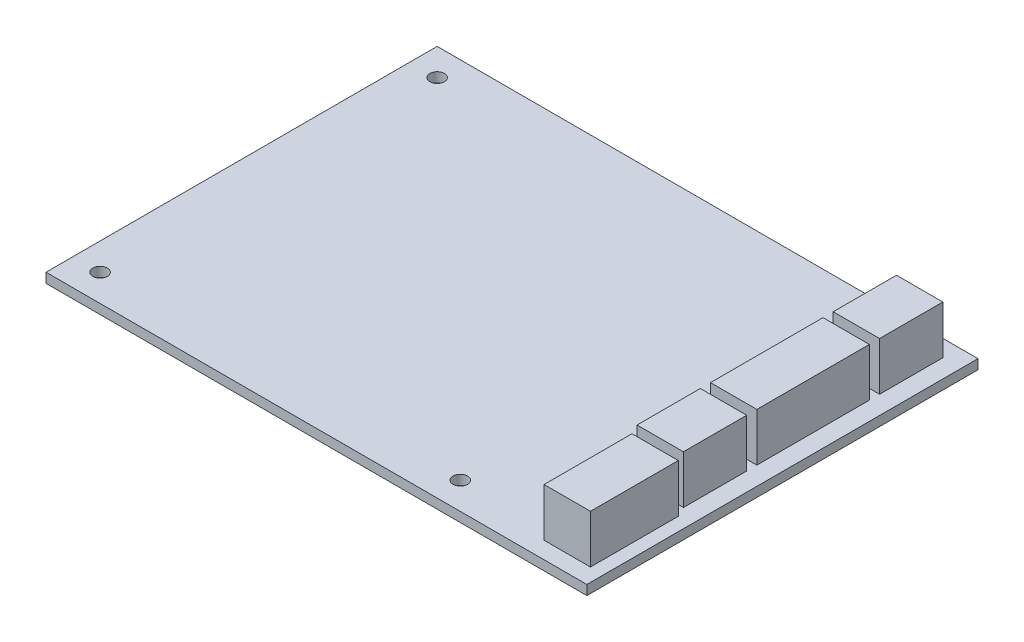
ISO-10303-21;
HEADER;
FILE_DESCRIPTION(('STEP AP214'),'2;1');
FILE_NAME('part.step','',(''),(''),'','','');
FILE_SCHEMA(('AUTOMOTIVE_DESIGN { 1 0 10303 214 1 1 1 1 }'));
ENDSEC;
DATA;
#1=APPLICATION_CONTEXT('core data for automotive mechanical design processes');
#2=APPLICATION_PROTOCOL_DEFINITION('international standard','automotive_design',2000,#1);
#3=PRODUCT_CONTEXT('',#1,'mechanical');
#4=PRODUCT('Part','Part','',(#3));
#5=PRODUCT_RELATED_PRODUCT_CATEGORY('part','',(#4));
#6=PRODUCT_DEFINITION_FORMATION('','',#4);
#7=PRODUCT_DEFINITION_CONTEXT('part definition',#1,'design');
#8=PRODUCT_DEFINITION('design','',#6,#7);
#9=PRODUCT_DEFINITION_SHAPE('','',#8);
#10=(LENGTH_UNIT() NAMED_UNIT(*) SI_UNIT(.MILLI.,.METRE.));
#11=(NAMED_UNIT(*) PLANE_ANGLE_UNIT() SI_UNIT($,.RADIAN.));
#12=(NAMED_UNIT(*) SI_UNIT($,.STERADIAN.) SOLID_ANGLE_UNIT());
#13=UNCERTAINTY_MEASURE_WITH_UNIT(LENGTH_MEASURE(1.E-05),#10,'distance_accuracy_value','');
#14=(GEOMETRIC_REPRESENTATION_CONTEXT(3) GLOBAL_UNCERTAINTY_ASSIGNED_CONTEXT((#13)) GLOBAL_UNIT_ASSIGNED_CONTEXT((#10,
#11,#12)) REPRESENTATION_CONTEXT('',''));
#15=CARTESIAN_POINT('',(0.,0.,0.));
#16=DIRECTION('',(0.,0.,1.));
#17=DIRECTION('',(1.,0.,0.));
#18=AXIS2_PLACEMENT_3D('',#15,#16,#17);
#19=CARTESIAN_POINT('',(56.,2.,40.5));
#20=DIRECTION('',(-1.,0.,0.));
#21=DIRECTION('',(0.,0.,1.));
#22=AXIS2_PLACEMENT_3D('',#19,#20,#21);
#23=PLANE('',#22);
#24=DIRECTION('',(0.,0.,-1.));
#25=VECTOR('',#24,1.);
#26=CARTESIAN_POINT('',(56.,0.,40.5));
#27=LINE('',#26,#25);
#28=CARTESIAN_POINT('',(56.,0.,40.5));
#29=VERTEX_POINT('',#28);
#30=CARTESIAN_POINT('',(56.,0.,-40.5));
#31=VERTEX_POINT('',#30);
#32=EDGE_CURVE('E394',#29,#31,#27,.T.);
#33=ORIENTED_EDGE('',*,*,#32,.T.);
#34=DIRECTION('',(0.,-1.,0.));
#35=VECTOR('',#34,1.);
#36=CARTESIAN_POINT('',(56.,2.,-40.5));
#37=LINE('',#36,#35);
#38=CARTESIAN_POINT('',(56.,2.,-40.5));
#39=VERTEX_POINT('',#38);
#40=EDGE_CURVE('E11',#39,#31,#37,.T.);
#41=ORIENTED_EDGE('',*,*,#40,.F.);
#42=DIRECTION('',(0.,0.,-1.));
#43=VECTOR('',#42,1.);
#44=CARTESIAN_POINT('',(56.,2.,40.5));
#45=LINE('',#44,#43);
#46=CARTESIAN_POINT('',(56.,2.,40.5));
#47=VERTEX_POINT('',#46);
#48=EDGE_CURVE('E379',#47,#39,#45,.T.);
#49=ORIENTED_EDGE('',*,*,#48,.F.);
#50=DIRECTION('',(0.,-1.,0.));
#51=VECTOR('',#50,1.);
#52=CARTESIAN_POINT('',(56.,2.,40.5));
#53=LINE('',#52,#51);
#54=EDGE_CURVE('E393',#47,#29,#53,.T.);
#55=ORIENTED_EDGE('',*,*,#54,.T.);
#56=EDGE_LOOP('',(#33,#41,#49,#55));
#57=FACE_BOUND('',#56,.T.);
#58=ADVANCED_FACE('F39',(#57),#23,.F.);
#59=CARTESIAN_POINT('',(-56.,2.,-40.5));
#60=DIRECTION('',(0.,0.,1.));
#61=DIRECTION('',(1.,0.,0.));
#62=AXIS2_PLACEMENT_3D('',#59,#60,#61);
#63=PLANE('',#62);
#64=DIRECTION('',(-1.,0.,0.));
#65=VECTOR('',#64,1.);
#66=CARTESIAN_POINT('',(-56.,0.,-40.5));
#67=LINE('',#66,#65);
#68=CARTESIAN_POINT('',(-56.,0.,-40.5));
#69=VERTEX_POINT('',#68);
#70=EDGE_CURVE('E398',#31,#69,#67,.T.);
#71=ORIENTED_EDGE('',*,*,#70,.T.);
#72=DIRECTION('',(0.,-1.,0.));
#73=VECTOR('',#72,1.);
#74=CARTESIAN_POINT('',(-56.,2.,-40.5));
#75=LINE('',#74,#73);
#76=CARTESIAN_POINT('',(-56.,2.,-40.5));
#77=VERTEX_POINT('',#76);
#78=EDGE_CURVE('E48',#77,#69,#75,.T.);
#79=ORIENTED_EDGE('',*,*,#78,.F.);
#80=DIRECTION('',(-1.,0.,0.));
#81=VECTOR('',#80,1.);
#82=CARTESIAN_POINT('',(-56.,2.,-40.5));
#83=LINE('',#82,#81);
#84=EDGE_CURVE('E383',#39,#77,#83,.T.);
#85=ORIENTED_EDGE('',*,*,#84,.F.);
#86=ORIENTED_EDGE('',*,*,#40,.T.);
#87=EDGE_LOOP('',(#71,#79,#85,#86));
#88=FACE_BOUND('',#87,.T.);
#89=ADVANCED_FACE('F461',(#88),#63,.F.);
#90=CARTESIAN_POINT('',(-56.,2.,40.5));
#91=DIRECTION('',(1.,0.,0.));
#92=DIRECTION('',(0.,0.,-1.));
#93=AXIS2_PLACEMENT_3D('',#90,#91,#92);
#94=PLANE('',#93);
#95=DIRECTION('',(0.,0.,1.));
#96=VECTOR('',#95,1.);
#97=CARTESIAN_POINT('',(-56.,0.,40.5));
#98=LINE('',#97,#96);
#99=CARTESIAN_POINT('',(-56.,0.,40.5));
#100=VERTEX_POINT('',#99);
#101=EDGE_CURVE('E401',#69,#100,#98,.T.);
#102=ORIENTED_EDGE('',*,*,#101,.T.);
#103=DIRECTION('',(0.,-1.,0.));
#104=VECTOR('',#103,1.);
#105=CARTESIAN_POINT('',(-56.,2.,40.5));
#106=LINE('',#105,#104);
#107=CARTESIAN_POINT('',(-56.,2.,40.5));
#108=VERTEX_POINT('',#107);
#109=EDGE_CURVE('E409',#108,#100,#106,.T.);
#110=ORIENTED_EDGE('',*,*,#109,.F.);
#111=DIRECTION('',(0.,0.,1.));
#112=VECTOR('',#111,1.);
#113=CARTESIAN_POINT('',(-56.,2.,40.5));
#114=LINE('',#113,#112);
#115=EDGE_CURVE('E387',#77,#108,#114,.T.);
#116=ORIENTED_EDGE('',*,*,#115,.F.);
#117=ORIENTED_EDGE('',*,*,#78,.T.);
#118=EDGE_LOOP('',(#102,#110,#116,#117));
#119=FACE_BOUND('',#118,.T.);
#120=ADVANCED_FACE('F458',(#119),#94,.F.);
#121=CARTESIAN_POINT('',(-56.,2.,40.5));
#122=DIRECTION('',(0.,0.,-1.));
#123=DIRECTION('',(-1.,0.,0.));
#124=AXIS2_PLACEMENT_3D('',#121,#122,#123);
#125=PLANE('',#124);
#126=DIRECTION('',(1.,0.,0.));
#127=VECTOR('',#126,1.);
#128=CARTESIAN_POINT('',(-56.,0.,40.5));
#129=LINE('',#128,#127);
#130=EDGE_CURVE('E384',#100,#29,#129,.T.);
#131=ORIENTED_EDGE('',*,*,#130,.T.);
#132=ORIENTED_EDGE('',*,*,#54,.F.);
#133=DIRECTION('',(1.,0.,0.));
#134=VECTOR('',#133,1.);
#135=CARTESIAN_POINT('',(-56.,2.,40.5));
#136=LINE('',#135,#134);
#137=EDGE_CURVE('E390',#108,#47,#136,.T.);
#138=ORIENTED_EDGE('',*,*,#137,.F.);
#139=ORIENTED_EDGE('',*,*,#109,.T.);
#140=EDGE_LOOP('',(#131,#132,#138,#139));
#141=FACE_BOUND('',#140,.T.);
#142=ADVANCED_FACE('F454',(#141),#125,.F.);
#143=CARTESIAN_POINT('',(0.,2.,0.));
#144=DIRECTION('',(0.,-1.,0.));
#145=DIRECTION('',(0.,0.,-1.));
#146=AXIS2_PLACEMENT_3D('',#143,#144,#145);
#147=PLANE('',#146);
#148=DIRECTION('',(-1.,0.,0.));
#149=VECTOR('',#148,1.);
#150=CARTESIAN_POINT('',(43.642,2.,37.));
#151=LINE('',#150,#149);
#152=CARTESIAN_POINT('',(53.242,2.,37.));
#153=VERTEX_POINT('',#152);
#154=CARTESIAN_POINT('',(43.642,2.,37.));
#155=VERTEX_POINT('',#154);
#156=EDGE_CURVE('E206',#153,#155,#151,.T.);
#157=ORIENTED_EDGE('',*,*,#156,.T.);
#158=DIRECTION('',(0.,0.,-1.));
#159=VECTOR('',#158,1.);
#160=CARTESIAN_POINT('',(43.642,2.,37.));
#161=LINE('',#160,#159);
#162=CARTESIAN_POINT('',(43.642,2.,18.8));
#163=VERTEX_POINT('',#162);
#164=EDGE_CURVE('E216',#155,#163,#161,.T.);
#165=ORIENTED_EDGE('',*,*,#164,.T.);
#166=DIRECTION('',(1.,0.,0.));
#167=VECTOR('',#166,1.);
#168=CARTESIAN_POINT('',(43.642,2.,18.8));
#169=LINE('',#168,#167);
#170=CARTESIAN_POINT('',(53.242,2.,18.8));
#171=VERTEX_POINT('',#170);
#172=EDGE_CURVE('E183',#163,#171,#169,.T.);
#173=ORIENTED_EDGE('',*,*,#172,.T.);
#174=DIRECTION('',(0.,0.,1.));
#175=VECTOR('',#174,1.);
#176=CARTESIAN_POINT('',(53.242,2.,37.));
#177=LINE('',#176,#175);
#178=EDGE_CURVE('E56',#171,#153,#177,.T.);
#179=ORIENTED_EDGE('',*,*,#178,.T.);
#180=EDGE_LOOP('',(#157,#165,#173,#179));
#181=FACE_BOUND('',#180,.T.);
#182=DIRECTION('',(-1.,0.,0.));
#183=VECTOR('',#182,1.);
#184=CARTESIAN_POINT('',(42.6,2.,-23.92));
#185=LINE('',#184,#183);
#186=CARTESIAN_POINT('',(52.2,2.,-23.92));
#187=VERTEX_POINT('',#186);
#188=CARTESIAN_POINT('',(42.6,2.,-23.92));
#189=VERTEX_POINT('',#188);
#190=EDGE_CURVE('E236',#187,#189,#185,.T.);
#191=ORIENTED_EDGE('',*,*,#190,.T.);
#192=DIRECTION('',(0.,0.,-1.));
#193=VECTOR('',#192,1.);
#194=CARTESIAN_POINT('',(42.6,2.,-23.92));
#195=LINE('',#194,#193);
#196=CARTESIAN_POINT('',(42.6,2.,-37.02));
#197=VERTEX_POINT('',#196);
#198=EDGE_CURVE('E225',#189,#197,#195,.T.);
#199=ORIENTED_EDGE('',*,*,#198,.T.);
#200=DIRECTION('',(1.,0.,0.));
#201=VECTOR('',#200,1.);
#202=CARTESIAN_POINT('',(42.6,2.,-37.02));
#203=LINE('',#202,#201);
#204=CARTESIAN_POINT('',(52.2,2.,-37.02));
#205=VERTEX_POINT('',#204);
#206=EDGE_CURVE('E252',#197,#205,#203,.T.);
#207=ORIENTED_EDGE('',*,*,#206,.T.);
#208=DIRECTION('',(0.,0.,1.));
#209=VECTOR('',#208,1.);
#210=CARTESIAN_POINT('',(52.2,2.,-23.92));
#211=LINE('',#210,#209);
#212=EDGE_CURVE('E64',#205,#187,#211,.T.);
#213=ORIENTED_EDGE('',*,*,#212,.T.);
#214=EDGE_LOOP('',(#191,#199,#207,#213));
#215=FACE_BOUND('',#214,.T.);
#216=DIRECTION('',(-1.,0.,0.));
#217=VECTOR('',#216,1.);
#218=CARTESIAN_POINT('',(42.6,2.,1.50000000000001));
#219=LINE('',#218,#217);
#220=CARTESIAN_POINT('',(52.2,2.,1.50000000000001));
#221=VERTEX_POINT('',#220);
#222=CARTESIAN_POINT('',(42.6,2.,1.50000000000001));
#223=VERTEX_POINT('',#222);
#224=EDGE_CURVE('E278',#221,#223,#219,.T.);
#225=ORIENTED_EDGE('',*,*,#224,.T.);
#226=DIRECTION('',(0.,0.,-1.));
#227=VECTOR('',#226,1.);
#228=CARTESIAN_POINT('',(42.6,2.,1.50000000000001));
#229=LINE('',#228,#227);
#230=CARTESIAN_POINT('',(42.6,2.,-21.8));
#231=VERTEX_POINT('',#230);
#232=EDGE_CURVE('E264',#223,#231,#229,.T.);
#233=ORIENTED_EDGE('',*,*,#232,.T.);
#234=DIRECTION('',(1.,0.,0.));
#235=VECTOR('',#234,1.);
#236=CARTESIAN_POINT('',(42.6,2.,-21.8));
#237=LINE('',#236,#235);
#238=CARTESIAN_POINT('',(52.2,2.,-21.8));
#239=VERTEX_POINT('',#238);
#240=EDGE_CURVE('E294',#231,#239,#237,.T.);
#241=ORIENTED_EDGE('',*,*,#240,.T.);
#242=DIRECTION('',(0.,0.,1.));
#243=VECTOR('',#242,1.);
#244=CARTESIAN_POINT('',(52.2,2.,1.50000000000001));
#245=LINE('',#244,#243);
#246=EDGE_CURVE('E298',#239,#221,#245,.T.);
#247=ORIENTED_EDGE('',*,*,#246,.T.);
#248=EDGE_LOOP('',(#225,#233,#241,#247));
#249=FACE_BOUND('',#248,.T.);
#250=DIRECTION('',(-1.,0.,0.));
#251=VECTOR('',#250,1.);
#252=CARTESIAN_POINT('',(42.6,2.,16.7));
#253=LINE('',#252,#251);
#254=CARTESIAN_POINT('',(52.2,2.,16.7));
#255=VERTEX_POINT('',#254);
#256=CARTESIAN_POINT('',(42.6,2.,16.7));
#257=VERTEX_POINT('',#256);
#258=EDGE_CURVE('E323',#255,#257,#253,.T.);
#259=ORIENTED_EDGE('',*,*,#258,.T.);
#260=DIRECTION('',(0.,0.,-1.));
#261=VECTOR('',#260,1.);
#262=CARTESIAN_POINT('',(42.6,2.,16.7));
#263=LINE('',#262,#261);
#264=CARTESIAN_POINT('',(42.6,2.,3.60000000000001));
#265=VERTEX_POINT('',#264);
#266=EDGE_CURVE('E308',#257,#265,#263,.T.);
#267=ORIENTED_EDGE('',*,*,#266,.T.);
#268=DIRECTION('',(1.,0.,0.));
#269=VECTOR('',#268,1.);
#270=CARTESIAN_POINT('',(42.6,2.,3.60000000000001));
#271=LINE('',#270,#269);
#272=CARTESIAN_POINT('',(52.2,2.,3.60000000000001));
#273=VERTEX_POINT('',#272);
#274=EDGE_CURVE('E339',#265,#273,#271,.T.);
#275=ORIENTED_EDGE('',*,*,#274,.T.);
#276=DIRECTION('',(0.,0.,1.));
#277=VECTOR('',#276,1.);
#278=CARTESIAN_POINT('',(52.2,2.,16.7));
#279=LINE('',#278,#277);
#280=EDGE_CURVE('E343',#273,#255,#279,.T.);
#281=ORIENTED_EDGE('',*,*,#280,.T.);
#282=EDGE_LOOP('',(#259,#267,#275,#281));
#283=FACE_BOUND('',#282,.T.);
#284=CARTESIAN_POINT('',(-50.4,2.,-34.9));
#285=DIRECTION('',(0.,1.,0.));
#286=DIRECTION('',(0.,0.,1.));
#287=AXIS2_PLACEMENT_3D('',#284,#285,#286);
#288=CIRCLE('',#287,1.5);
#289=CARTESIAN_POINT('',(-50.4,2.,-33.4));
#290=VERTEX_POINT('',#289);
#291=EDGE_CURVE('E363',#290,#290,#288,.T.);
#292=ORIENTED_EDGE('',*,*,#291,.F.);
#293=EDGE_LOOP('',(#292));
#294=FACE_BOUND('',#293,.T.);
#295=CARTESIAN_POINT('',(-50.4,2.,34.9));
#296=DIRECTION('',(0.,1.,0.));
#297=DIRECTION('',(0.,0.,1.));
#298=AXIS2_PLACEMENT_3D('',#295,#296,#297);
#299=CIRCLE('',#298,1.5);
#300=CARTESIAN_POINT('',(-50.4,2.,36.4));
#301=VERTEX_POINT('',#300);
#302=EDGE_CURVE('E368',#301,#301,#299,.T.);
#303=ORIENTED_EDGE('',*,*,#302,.F.);
#304=EDGE_LOOP('',(#303));
#305=FACE_BOUND('',#304,.T.);
#306=CARTESIAN_POINT('',(24.2,2.,34.9));
#307=DIRECTION('',(0.,1.,0.));
#308=DIRECTION('',(0.,0.,1.));
#309=AXIS2_PLACEMENT_3D('',#306,#307,#308);
#310=CIRCLE('',#309,1.5);
#311=CARTESIAN_POINT('',(24.2,2.,36.4));
#312=VERTEX_POINT('',#311);
#313=EDGE_CURVE('E372',#312,#312,#310,.T.);
#314=ORIENTED_EDGE('',*,*,#313,.F.);
#315=EDGE_LOOP('',(#314));
#316=FACE_BOUND('',#315,.T.);
#317=CARTESIAN_POINT('',(37.7,2.,-18.1));
#318=DIRECTION('',(0.,1.,0.));
#319=DIRECTION('',(0.,0.,1.));
#320=AXIS2_PLACEMENT_3D('',#317,#318,#319);
#321=CIRCLE('',#320,1.5);
#322=CARTESIAN_POINT('',(37.7,2.,-16.6));
#323=VERTEX_POINT('',#322);
#324=EDGE_CURVE('E353',#323,#323,#321,.T.);
#325=ORIENTED_EDGE('',*,*,#324,.F.);
#326=EDGE_LOOP('',(#325));
#327=FACE_BOUND('',#326,.T.);
#328=ORIENTED_EDGE('',*,*,#48,.T.);
#329=ORIENTED_EDGE('',*,*,#84,.T.);
#330=ORIENTED_EDGE('',*,*,#115,.T.);
#331=ORIENTED_EDGE('',*,*,#137,.T.);
#332=EDGE_LOOP('',(#328,#329,#330,#331));
#333=FACE_BOUND('',#332,.T.);
#334=ADVANCED_FACE('F438',(#181,#215,#249,#283,#294,#305,#316,#327,#333),#147,.F.);
#335=CARTESIAN_POINT('',(0.,0.,0.));
#336=DIRECTION('',(0.,-1.,0.));
#337=DIRECTION('',(0.,0.,-1.));
#338=AXIS2_PLACEMENT_3D('',#335,#336,#337);
#339=PLANE('',#338);
#340=CARTESIAN_POINT('',(-50.4,0.,-34.9));
#341=DIRECTION('',(0.,-1.,0.));
#342=DIRECTION('',(0.,0.,-1.));
#343=AXIS2_PLACEMENT_3D('',#340,#341,#342);
#344=CIRCLE('',#343,1.5);
#345=CARTESIAN_POINT('',(-50.4,0.,-36.4));
#346=VERTEX_POINT('',#345);
#347=EDGE_CURVE('E42',#346,#346,#344,.T.);
#348=ORIENTED_EDGE('',*,*,#347,.F.);
#349=EDGE_LOOP('',(#348));
#350=FACE_BOUND('',#349,.T.);
#351=CARTESIAN_POINT('',(-50.4,0.,34.9));
#352=DIRECTION('',(0.,-1.,0.));
#353=DIRECTION('',(0.,0.,-1.));
#354=AXIS2_PLACEMENT_3D('',#351,#352,#353);
#355=CIRCLE('',#354,1.5);
#356=CARTESIAN_POINT('',(-50.4,0.,33.4));
#357=VERTEX_POINT('',#356);
#358=EDGE_CURVE('E422',#357,#357,#355,.T.);
#359=ORIENTED_EDGE('',*,*,#358,.F.);
#360=EDGE_LOOP('',(#359));
#361=FACE_BOUND('',#360,.T.);
#362=CARTESIAN_POINT('',(24.2,0.,34.9));
#363=DIRECTION('',(0.,-1.,0.));
#364=DIRECTION('',(0.,0.,-1.));
#365=AXIS2_PLACEMENT_3D('',#362,#363,#364);
#366=CIRCLE('',#365,1.5);
#367=CARTESIAN_POINT('',(24.2,0.,33.4));
#368=VERTEX_POINT('',#367);
#369=EDGE_CURVE('E419',#368,#368,#366,.T.);
#370=ORIENTED_EDGE('',*,*,#369,.F.);
#371=EDGE_LOOP('',(#370));
#372=FACE_BOUND('',#371,.T.);
#373=CARTESIAN_POINT('',(37.7,0.,-18.1));
#374=DIRECTION('',(0.,-1.,0.));
#375=DIRECTION('',(0.,0.,-1.));
#376=AXIS2_PLACEMENT_3D('',#373,#374,#375);
#377=CIRCLE('',#376,1.5);
#378=CARTESIAN_POINT('',(37.7,0.,-19.6));
#379=VERTEX_POINT('',#378);
#380=EDGE_CURVE('E367',#379,#379,#377,.T.);
#381=ORIENTED_EDGE('',*,*,#380,.F.);
#382=EDGE_LOOP('',(#381));
#383=FACE_BOUND('',#382,.T.);
#384=ORIENTED_EDGE('',*,*,#32,.F.);
#385=ORIENTED_EDGE('',*,*,#130,.F.);
#386=ORIENTED_EDGE('',*,*,#101,.F.);
#387=ORIENTED_EDGE('',*,*,#70,.F.);
#388=EDGE_LOOP('',(#384,#385,#386,#387));
#389=FACE_BOUND('',#388,.T.);
#390=ADVANCED_FACE('F434',(#350,#361,#372,#383,#389),#339,.T.);
#391=CARTESIAN_POINT('',(37.7,-8.,-18.1));
#392=DIRECTION('',(0.,1.,0.));
#393=DIRECTION('',(0.,0.,1.));
#394=AXIS2_PLACEMENT_3D('',#391,#392,#393);
#395=CYLINDRICAL_SURFACE('',#394,1.5);
#396=ORIENTED_EDGE('',*,*,#380,.T.);
#397=EDGE_LOOP('',(#396));
#398=FACE_BOUND('',#397,.T.);
#399=ORIENTED_EDGE('',*,*,#324,.T.);
#400=EDGE_LOOP('',(#399));
#401=FACE_BOUND('',#400,.T.);
#402=ADVANCED_FACE('F437',(#398,#401),#395,.F.);
#403=CARTESIAN_POINT('',(24.2,-8.,34.9));
#404=DIRECTION('',(0.,1.,0.));
#405=DIRECTION('',(0.,0.,1.));
#406=AXIS2_PLACEMENT_3D('',#403,#404,#405);
#407=CYLINDRICAL_SURFACE('',#406,1.5);
#408=ORIENTED_EDGE('',*,*,#369,.T.);
#409=EDGE_LOOP('',(#408));
#410=FACE_BOUND('',#409,.T.);
#411=ORIENTED_EDGE('',*,*,#313,.T.);
#412=EDGE_LOOP('',(#411));
#413=FACE_BOUND('',#412,.T.);
#414=ADVANCED_FACE('F502',(#410,#413),#407,.F.);
#415=CARTESIAN_POINT('',(-50.4,-8.,34.9));
#416=DIRECTION('',(0.,1.,0.));
#417=DIRECTION('',(0.,0.,1.));
#418=AXIS2_PLACEMENT_3D('',#415,#416,#417);
#419=CYLINDRICAL_SURFACE('',#418,1.5);
#420=ORIENTED_EDGE('',*,*,#358,.T.);
#421=EDGE_LOOP('',(#420));
#422=FACE_BOUND('',#421,.T.);
#423=ORIENTED_EDGE('',*,*,#302,.T.);
#424=EDGE_LOOP('',(#423));
#425=FACE_BOUND('',#424,.T.);
#426=ADVANCED_FACE('F511',(#422,#425),#419,.F.);
#427=CARTESIAN_POINT('',(-50.4,-8.,-34.9));
#428=DIRECTION('',(0.,1.,0.));
#429=DIRECTION('',(0.,0.,1.));
#430=AXIS2_PLACEMENT_3D('',#427,#428,#429);
#431=CYLINDRICAL_SURFACE('',#430,1.5);
#432=ORIENTED_EDGE('',*,*,#347,.T.);
#433=EDGE_LOOP('',(#432));
#434=FACE_BOUND('',#433,.T.);
#435=ORIENTED_EDGE('',*,*,#291,.T.);
#436=EDGE_LOOP('',(#435));
#437=FACE_BOUND('',#436,.T.);
#438=ADVANCED_FACE('F431',(#434,#437),#431,.F.);
#439=CARTESIAN_POINT('',(42.6,12.,16.7));
#440=DIRECTION('',(-1.,0.,0.));
#441=DIRECTION('',(0.,0.,1.));
#442=AXIS2_PLACEMENT_3D('',#439,#440,#441);
#443=PLANE('',#442);
#444=ORIENTED_EDGE('',*,*,#266,.F.);
#445=DIRECTION('',(0.,-1.,0.));
#446=VECTOR('',#445,1.);
#447=CARTESIAN_POINT('',(42.6,12.,16.7));
#448=LINE('',#447,#446);
#449=CARTESIAN_POINT('',(42.6,12.,16.7));
#450=VERTEX_POINT('',#449);
#451=EDGE_CURVE('E350',#450,#257,#448,.T.);
#452=ORIENTED_EDGE('',*,*,#451,.F.);
#453=DIRECTION('',(0.,0.,-1.));
#454=VECTOR('',#453,1.);
#455=CARTESIAN_POINT('',(42.6,12.,16.7));
#456=LINE('',#455,#454);
#457=CARTESIAN_POINT('',(42.6,12.,3.60000000000001));
#458=VERTEX_POINT('',#457);
#459=EDGE_CURVE('E318',#450,#458,#456,.T.);
#460=ORIENTED_EDGE('',*,*,#459,.T.);
#461=DIRECTION('',(0.,-1.,0.));
#462=VECTOR('',#461,1.);
#463=CARTESIAN_POINT('',(42.6,12.,3.60000000000001));
#464=LINE('',#463,#462);
#465=EDGE_CURVE('E335',#458,#265,#464,.T.);
#466=ORIENTED_EDGE('',*,*,#465,.T.);
#467=EDGE_LOOP('',(#444,#452,#460,#466));
#468=FACE_BOUND('',#467,.T.);
#469=ADVANCED_FACE('F528',(#468),#443,.T.);
#470=CARTESIAN_POINT('',(42.6,12.,16.7));
#471=DIRECTION('',(0.,0.,1.));
#472=DIRECTION('',(1.,0.,0.));
#473=AXIS2_PLACEMENT_3D('',#470,#471,#472);
#474=PLANE('',#473);
#475=ORIENTED_EDGE('',*,*,#258,.F.);
#476=DIRECTION('',(0.,-1.,0.));
#477=VECTOR('',#476,1.);
#478=CARTESIAN_POINT('',(52.2,12.,16.7));
#479=LINE('',#478,#477);
#480=CARTESIAN_POINT('',(52.2,12.,16.7));
#481=VERTEX_POINT('',#480);
#482=EDGE_CURVE('E354',#481,#255,#479,.T.);
#483=ORIENTED_EDGE('',*,*,#482,.F.);
#484=DIRECTION('',(-1.,0.,0.));
#485=VECTOR('',#484,1.);
#486=CARTESIAN_POINT('',(42.6,12.,16.7));
#487=LINE('',#486,#485);
#488=EDGE_CURVE('E331',#481,#450,#487,.T.);
#489=ORIENTED_EDGE('',*,*,#488,.T.);
#490=ORIENTED_EDGE('',*,*,#451,.T.);
#491=EDGE_LOOP('',(#475,#483,#489,#490));
#492=FACE_BOUND('',#491,.T.);
#493=ADVANCED_FACE('F541',(#492),#474,.T.);
#494=CARTESIAN_POINT('',(52.2,12.,16.7));
#495=DIRECTION('',(1.,0.,0.));
#496=DIRECTION('',(0.,0.,-1.));
#497=AXIS2_PLACEMENT_3D('',#494,#495,#496);
#498=PLANE('',#497);
#499=ORIENTED_EDGE('',*,*,#280,.F.);
#500=DIRECTION('',(0.,-1.,0.));
#501=VECTOR('',#500,1.);
#502=CARTESIAN_POINT('',(52.2,12.,3.60000000000001));
#503=LINE('',#502,#501);
#504=CARTESIAN_POINT('',(52.2,12.,3.60000000000001));
#505=VERTEX_POINT('',#504);
#506=EDGE_CURVE('E357',#505,#273,#503,.T.);
#507=ORIENTED_EDGE('',*,*,#506,.F.);
#508=DIRECTION('',(0.,0.,1.));
#509=VECTOR('',#508,1.);
#510=CARTESIAN_POINT('',(52.2,12.,16.7));
#511=LINE('',#510,#509);
#512=EDGE_CURVE('E327',#505,#481,#511,.T.);
#513=ORIENTED_EDGE('',*,*,#512,.T.);
#514=ORIENTED_EDGE('',*,*,#482,.T.);
#515=EDGE_LOOP('',(#499,#507,#513,#514));
#516=FACE_BOUND('',#515,.T.);
#517=ADVANCED_FACE('F551',(#516),#498,.T.);
#518=CARTESIAN_POINT('',(42.6,12.,3.60000000000001));
#519=DIRECTION('',(0.,0.,-1.));
#520=DIRECTION('',(-1.,0.,0.));
#521=AXIS2_PLACEMENT_3D('',#518,#519,#520);
#522=PLANE('',#521);
#523=ORIENTED_EDGE('',*,*,#274,.F.);
#524=ORIENTED_EDGE('',*,*,#465,.F.);
#525=DIRECTION('',(1.,0.,0.));
#526=VECTOR('',#525,1.);
#527=CARTESIAN_POINT('',(42.6,12.,3.60000000000001));
#528=LINE('',#527,#526);
#529=EDGE_CURVE('E322',#458,#505,#528,.T.);
#530=ORIENTED_EDGE('',*,*,#529,.T.);
#531=ORIENTED_EDGE('',*,*,#506,.T.);
#532=EDGE_LOOP('',(#523,#524,#530,#531));
#533=FACE_BOUND('',#532,.T.);
#534=ADVANCED_FACE('F561',(#533),#522,.T.);
#535=CARTESIAN_POINT('',(0.,12.,0.));
#536=DIRECTION('',(0.,-1.,0.));
#537=DIRECTION('',(0.,0.,-1.));
#538=AXIS2_PLACEMENT_3D('',#535,#536,#537);
#539=PLANE('',#538);
#540=ORIENTED_EDGE('',*,*,#459,.F.);
#541=ORIENTED_EDGE('',*,*,#488,.F.);
#542=ORIENTED_EDGE('',*,*,#512,.F.);
#543=ORIENTED_EDGE('',*,*,#529,.F.);
#544=EDGE_LOOP('',(#540,#541,#542,#543));
#545=FACE_BOUND('',#544,.T.);
#546=ADVANCED_FACE('F571',(#545),#539,.F.);
#547=CARTESIAN_POINT('',(42.6,12.,1.50000000000001));
#548=DIRECTION('',(-1.,0.,0.));
#549=DIRECTION('',(0.,0.,1.));
#550=AXIS2_PLACEMENT_3D('',#547,#548,#549);
#551=PLANE('',#550);
#552=ORIENTED_EDGE('',*,*,#232,.F.);
#553=DIRECTION('',(0.,-1.,0.));
#554=VECTOR('',#553,1.);
#555=CARTESIAN_POINT('',(42.6,12.,1.50000000000001));
#556=LINE('',#555,#554);
#557=CARTESIAN_POINT('',(42.6,12.,1.50000000000001));
#558=VERTEX_POINT('',#557);
#559=EDGE_CURVE('E305',#558,#223,#556,.T.);
#560=ORIENTED_EDGE('',*,*,#559,.F.);
#561=DIRECTION('',(0.,0.,-1.));
#562=VECTOR('',#561,1.);
#563=CARTESIAN_POINT('',(42.6,12.,1.50000000000001));
#564=LINE('',#563,#562);
#565=CARTESIAN_POINT('',(42.6,12.,-21.8));
#566=VERTEX_POINT('',#565);
#567=EDGE_CURVE('E273',#558,#566,#564,.T.);
#568=ORIENTED_EDGE('',*,*,#567,.T.);
#569=DIRECTION('',(0.,-1.,0.));
#570=VECTOR('',#569,1.);
#571=CARTESIAN_POINT('',(42.6,12.,-21.8));
#572=LINE('',#571,#570);
#573=EDGE_CURVE('E290',#566,#231,#572,.T.);
#574=ORIENTED_EDGE('',*,*,#573,.T.);
#575=EDGE_LOOP('',(#552,#560,#568,#574));
#576=FACE_BOUND('',#575,.T.);
#577=ADVANCED_FACE('F581',(#576),#551,.T.);
#578=CARTESIAN_POINT('',(42.6,12.,1.50000000000001));
#579=DIRECTION('',(0.,0.,1.));
#580=DIRECTION('',(1.,0.,0.));
#581=AXIS2_PLACEMENT_3D('',#578,#579,#580);
#582=PLANE('',#581);
#583=ORIENTED_EDGE('',*,*,#224,.F.);
#584=DIRECTION('',(0.,-1.,0.));
#585=VECTOR('',#584,1.);
#586=CARTESIAN_POINT('',(52.2,12.,1.50000000000001));
#587=LINE('',#586,#585);
#588=CARTESIAN_POINT('',(52.2,12.,1.50000000000001));
#589=VERTEX_POINT('',#588);
#590=EDGE_CURVE('E309',#589,#221,#587,.T.);
#591=ORIENTED_EDGE('',*,*,#590,.F.);
#592=DIRECTION('',(-1.,0.,0.));
#593=VECTOR('',#592,1.);
#594=CARTESIAN_POINT('',(42.6,12.,1.50000000000001));
#595=LINE('',#594,#593);
#596=EDGE_CURVE('E286',#589,#558,#595,.T.);
#597=ORIENTED_EDGE('',*,*,#596,.T.);
#598=ORIENTED_EDGE('',*,*,#559,.T.);
#599=EDGE_LOOP('',(#583,#591,#597,#598));
#600=FACE_BOUND('',#599,.T.);
#601=ADVANCED_FACE('F591',(#600),#582,.T.);
#602=CARTESIAN_POINT('',(52.2,12.,1.50000000000001));
#603=DIRECTION('',(1.,0.,0.));
#604=DIRECTION('',(0.,0.,-1.));
#605=AXIS2_PLACEMENT_3D('',#602,#603,#604);
#606=PLANE('',#605);
#607=ORIENTED_EDGE('',*,*,#246,.F.);
#608=DIRECTION('',(0.,-1.,0.));
#609=VECTOR('',#608,1.);
#610=CARTESIAN_POINT('',(52.2,12.,-21.8));
#611=LINE('',#610,#609);
#612=CARTESIAN_POINT('',(52.2,12.,-21.8));
#613=VERTEX_POINT('',#612);
#614=EDGE_CURVE('E312',#613,#239,#611,.T.);
#615=ORIENTED_EDGE('',*,*,#614,.F.);
#616=DIRECTION('',(0.,0.,1.));
#617=VECTOR('',#616,1.);
#618=CARTESIAN_POINT('',(52.2,12.,1.50000000000001));
#619=LINE('',#618,#617);
#620=EDGE_CURVE('E282',#613,#589,#619,.T.);
#621=ORIENTED_EDGE('',*,*,#620,.T.);
#622=ORIENTED_EDGE('',*,*,#590,.T.);
#623=EDGE_LOOP('',(#607,#615,#621,#622));
#624=FACE_BOUND('',#623,.T.);
#625=ADVANCED_FACE('F601',(#624),#606,.T.);
#626=CARTESIAN_POINT('',(42.6,12.,-21.8));
#627=DIRECTION('',(0.,0.,-1.));
#628=DIRECTION('',(-1.,0.,0.));
#629=AXIS2_PLACEMENT_3D('',#626,#627,#628);
#630=PLANE('',#629);
#631=ORIENTED_EDGE('',*,*,#240,.F.);
#632=ORIENTED_EDGE('',*,*,#573,.F.);
#633=DIRECTION('',(1.,0.,0.));
#634=VECTOR('',#633,1.);
#635=CARTESIAN_POINT('',(42.6,12.,-21.8));
#636=LINE('',#635,#634);
#637=EDGE_CURVE('E277',#566,#613,#636,.T.);
#638=ORIENTED_EDGE('',*,*,#637,.T.);
#639=ORIENTED_EDGE('',*,*,#614,.T.);
#640=EDGE_LOOP('',(#631,#632,#638,#639));
#641=FACE_BOUND('',#640,.T.);
#642=ADVANCED_FACE('F611',(#641),#630,.T.);
#643=CARTESIAN_POINT('',(0.,12.,0.));
#644=DIRECTION('',(0.,-1.,0.));
#645=DIRECTION('',(0.,0.,-1.));
#646=AXIS2_PLACEMENT_3D('',#643,#644,#645);
#647=PLANE('',#646);
#648=ORIENTED_EDGE('',*,*,#567,.F.);
#649=ORIENTED_EDGE('',*,*,#596,.F.);
#650=ORIENTED_EDGE('',*,*,#620,.F.);
#651=ORIENTED_EDGE('',*,*,#637,.F.);
#652=EDGE_LOOP('',(#648,#649,#650,#651));
#653=FACE_BOUND('',#652,.T.);
#654=ADVANCED_FACE('F621',(#653),#647,.F.);
#655=CARTESIAN_POINT('',(42.6,12.,-23.92));
#656=DIRECTION('',(-1.,0.,0.));
#657=DIRECTION('',(0.,0.,1.));
#658=AXIS2_PLACEMENT_3D('',#655,#656,#657);
#659=PLANE('',#658);
#660=ORIENTED_EDGE('',*,*,#198,.F.);
#661=DIRECTION('',(0.,-1.,0.));
#662=VECTOR('',#661,1.);
#663=CARTESIAN_POINT('',(42.6,12.,-23.92));
#664=LINE('',#663,#662);
#665=CARTESIAN_POINT('',(42.6,12.,-23.92));
#666=VERTEX_POINT('',#665);
#667=EDGE_CURVE('E261',#666,#189,#664,.T.);
#668=ORIENTED_EDGE('',*,*,#667,.F.);
#669=DIRECTION('',(0.,0.,-1.));
#670=VECTOR('',#669,1.);
#671=CARTESIAN_POINT('',(42.6,12.,-23.92));
#672=LINE('',#671,#670);
#673=CARTESIAN_POINT('',(42.6,12.,-37.02));
#674=VERTEX_POINT('',#673);
#675=EDGE_CURVE('E231',#666,#674,#672,.T.);
#676=ORIENTED_EDGE('',*,*,#675,.T.);
#677=DIRECTION('',(0.,-1.,0.));
#678=VECTOR('',#677,1.);
#679=CARTESIAN_POINT('',(42.6,12.,-37.02));
#680=LINE('',#679,#678);
#681=EDGE_CURVE('E248',#674,#197,#680,.T.);
#682=ORIENTED_EDGE('',*,*,#681,.T.);
#683=EDGE_LOOP('',(#660,#668,#676,#682));
#684=FACE_BOUND('',#683,.T.);
#685=ADVANCED_FACE('F631',(#684),#659,.T.);
#686=CARTESIAN_POINT('',(42.6,12.,-23.92));
#687=DIRECTION('',(0.,0.,1.));
#688=DIRECTION('',(1.,0.,0.));
#689=AXIS2_PLACEMENT_3D('',#686,#687,#688);
#690=PLANE('',#689);
#691=ORIENTED_EDGE('',*,*,#190,.F.);
#692=DIRECTION('',(0.,-1.,0.));
#693=VECTOR('',#692,1.);
#694=CARTESIAN_POINT('',(52.2,12.,-23.92));
#695=LINE('',#694,#693);
#696=CARTESIAN_POINT('',(52.2,12.,-23.92));
#697=VERTEX_POINT('',#696);
#698=EDGE_CURVE('E265',#697,#187,#695,.T.);
#699=ORIENTED_EDGE('',*,*,#698,.F.);
#700=DIRECTION('',(-1.,0.,0.));
#701=VECTOR('',#700,1.);
#702=CARTESIAN_POINT('',(42.6,12.,-23.92));
#703=LINE('',#702,#701);
#704=EDGE_CURVE('E244',#697,#666,#703,.T.);
#705=ORIENTED_EDGE('',*,*,#704,.T.);
#706=ORIENTED_EDGE('',*,*,#667,.T.);
#707=EDGE_LOOP('',(#691,#699,#705,#706));
#708=FACE_BOUND('',#707,.T.);
#709=ADVANCED_FACE('F641',(#708),#690,.T.);
#710=CARTESIAN_POINT('',(52.2,12.,-23.92));
#711=DIRECTION('',(1.,0.,0.));
#712=DIRECTION('',(0.,0.,-1.));
#713=AXIS2_PLACEMENT_3D('',#710,#711,#712);
#714=PLANE('',#713);
#715=ORIENTED_EDGE('',*,*,#212,.F.);
#716=DIRECTION('',(0.,-1.,0.));
#717=VECTOR('',#716,1.);
#718=CARTESIAN_POINT('',(52.2,12.,-37.02));
#719=LINE('',#718,#717);
#720=CARTESIAN_POINT('',(52.2,12.,-37.02));
#721=VERTEX_POINT('',#720);
#722=EDGE_CURVE('E268',#721,#205,#719,.T.);
#723=ORIENTED_EDGE('',*,*,#722,.F.);
#724=DIRECTION('',(0.,0.,1.));
#725=VECTOR('',#724,1.);
#726=CARTESIAN_POINT('',(52.2,12.,-23.92));
#727=LINE('',#726,#725);
#728=EDGE_CURVE('E240',#721,#697,#727,.T.);
#729=ORIENTED_EDGE('',*,*,#728,.T.);
#730=ORIENTED_EDGE('',*,*,#698,.T.);
#731=EDGE_LOOP('',(#715,#723,#729,#730));
#732=FACE_BOUND('',#731,.T.);
#733=ADVANCED_FACE('F651',(#732),#714,.T.);
#734=CARTESIAN_POINT('',(42.6,12.,-37.02));
#735=DIRECTION('',(0.,0.,-1.));
#736=DIRECTION('',(-1.,0.,0.));
#737=AXIS2_PLACEMENT_3D('',#734,#735,#736);
#738=PLANE('',#737);
#739=ORIENTED_EDGE('',*,*,#206,.F.);
#740=ORIENTED_EDGE('',*,*,#681,.F.);
#741=DIRECTION('',(1.,0.,0.));
#742=VECTOR('',#741,1.);
#743=CARTESIAN_POINT('',(42.6,12.,-37.02));
#744=LINE('',#743,#742);
#745=EDGE_CURVE('E235',#674,#721,#744,.T.);
#746=ORIENTED_EDGE('',*,*,#745,.T.);
#747=ORIENTED_EDGE('',*,*,#722,.T.);
#748=EDGE_LOOP('',(#739,#740,#746,#747));
#749=FACE_BOUND('',#748,.T.);
#750=ADVANCED_FACE('F661',(#749),#738,.T.);
#751=CARTESIAN_POINT('',(0.,12.,0.));
#752=DIRECTION('',(0.,-1.,0.));
#753=DIRECTION('',(0.,0.,-1.));
#754=AXIS2_PLACEMENT_3D('',#751,#752,#753);
#755=PLANE('',#754);
#756=ORIENTED_EDGE('',*,*,#675,.F.);
#757=ORIENTED_EDGE('',*,*,#704,.F.);
#758=ORIENTED_EDGE('',*,*,#728,.F.);
#759=ORIENTED_EDGE('',*,*,#745,.F.);
#760=EDGE_LOOP('',(#756,#757,#758,#759));
#761=FACE_BOUND('',#760,.T.);
#762=ADVANCED_FACE('F670',(#761),#755,.F.);
#763=CARTESIAN_POINT('',(43.642,12.,37.));
#764=DIRECTION('',(-1.,0.,0.));
#765=DIRECTION('',(0.,0.,1.));
#766=AXIS2_PLACEMENT_3D('',#763,#764,#765);
#767=PLANE('',#766);
#768=ORIENTED_EDGE('',*,*,#164,.F.);
#769=DIRECTION('',(0.,-1.,0.));
#770=VECTOR('',#769,1.);
#771=CARTESIAN_POINT('',(43.642,12.,37.));
#772=LINE('',#771,#770);
#773=CARTESIAN_POINT('',(43.642,12.,37.));
#774=VERTEX_POINT('',#773);
#775=EDGE_CURVE('E204',#774,#155,#772,.T.);
#776=ORIENTED_EDGE('',*,*,#775,.F.);
#777=DIRECTION('',(0.,0.,-1.));
#778=VECTOR('',#777,1.);
#779=CARTESIAN_POINT('',(43.642,12.,37.));
#780=LINE('',#779,#778);
#781=CARTESIAN_POINT('',(43.642,12.,18.8));
#782=VERTEX_POINT('',#781);
#783=EDGE_CURVE('E197',#774,#782,#780,.T.);
#784=ORIENTED_EDGE('',*,*,#783,.T.);
#785=DIRECTION('',(0.,-1.,0.));
#786=VECTOR('',#785,1.);
#787=CARTESIAN_POINT('',(43.642,12.,18.8));
#788=LINE('',#787,#786);
#789=EDGE_CURVE('E178',#782,#163,#788,.T.);
#790=ORIENTED_EDGE('',*,*,#789,.T.);
#791=EDGE_LOOP('',(#768,#776,#784,#790));
#792=FACE_BOUND('',#791,.T.);
#793=ADVANCED_FACE('F203',(#792),#767,.T.);
#794=CARTESIAN_POINT('',(43.642,12.,37.));
#795=DIRECTION('',(0.,0.,1.));
#796=DIRECTION('',(1.,0.,0.));
#797=AXIS2_PLACEMENT_3D('',#794,#795,#796);
#798=PLANE('',#797);
#799=ORIENTED_EDGE('',*,*,#156,.F.);
#800=DIRECTION('',(0.,-1.,0.));
#801=VECTOR('',#800,1.);
#802=CARTESIAN_POINT('',(53.242,12.,37.));
#803=LINE('',#802,#801);
#804=CARTESIAN_POINT('',(53.242,12.,37.));
#805=VERTEX_POINT('',#804);
#806=EDGE_CURVE('E226',#805,#153,#803,.T.);
#807=ORIENTED_EDGE('',*,*,#806,.F.);
#808=DIRECTION('',(-1.,0.,0.));
#809=VECTOR('',#808,1.);
#810=CARTESIAN_POINT('',(43.642,12.,37.));
#811=LINE('',#810,#809);
#812=EDGE_CURVE('E190',#805,#774,#811,.T.);
#813=ORIENTED_EDGE('',*,*,#812,.T.);
#814=ORIENTED_EDGE('',*,*,#775,.T.);
#815=EDGE_LOOP('',(#799,#807,#813,#814));
#816=FACE_BOUND('',#815,.T.);
#817=ADVANCED_FACE('F689',(#816),#798,.T.);
#818=CARTESIAN_POINT('',(53.242,12.,37.));
#819=DIRECTION('',(1.,0.,0.));
#820=DIRECTION('',(0.,0.,-1.));
#821=AXIS2_PLACEMENT_3D('',#818,#819,#820);
#822=PLANE('',#821);
#823=ORIENTED_EDGE('',*,*,#178,.F.);
#824=DIRECTION('',(0.,-1.,0.));
#825=VECTOR('',#824,1.);
#826=CARTESIAN_POINT('',(53.242,12.,18.8));
#827=LINE('',#826,#825);
#828=CARTESIAN_POINT('',(53.242,12.,18.8));
#829=VERTEX_POINT('',#828);
#830=EDGE_CURVE('E189',#829,#171,#827,.T.);
#831=ORIENTED_EDGE('',*,*,#830,.F.);
#832=DIRECTION('',(0.,0.,1.));
#833=VECTOR('',#832,1.);
#834=CARTESIAN_POINT('',(53.242,12.,37.));
#835=LINE('',#834,#833);
#836=EDGE_CURVE('E200',#829,#805,#835,.T.);
#837=ORIENTED_EDGE('',*,*,#836,.T.);
#838=ORIENTED_EDGE('',*,*,#806,.T.);
#839=EDGE_LOOP('',(#823,#831,#837,#838));
#840=FACE_BOUND('',#839,.T.);
#841=ADVANCED_FACE('F698',(#840),#822,.T.);
#842=CARTESIAN_POINT('',(43.642,12.,18.8));
#843=DIRECTION('',(0.,0.,-1.));
#844=DIRECTION('',(-1.,0.,0.));
#845=AXIS2_PLACEMENT_3D('',#842,#843,#844);
#846=PLANE('',#845);
#847=ORIENTED_EDGE('',*,*,#172,.F.);
#848=ORIENTED_EDGE('',*,*,#789,.F.);
#849=DIRECTION('',(1.,0.,0.));
#850=VECTOR('',#849,1.);
#851=CARTESIAN_POINT('',(43.642,12.,18.8));
#852=LINE('',#851,#850);
#853=EDGE_CURVE('E181',#782,#829,#852,.T.);
#854=ORIENTED_EDGE('',*,*,#853,.T.);
#855=ORIENTED_EDGE('',*,*,#830,.T.);
#856=EDGE_LOOP('',(#847,#848,#854,#855));
#857=FACE_BOUND('',#856,.T.);
#858=ADVANCED_FACE('F180',(#857),#846,.T.);
#859=CARTESIAN_POINT('',(0.,12.,0.));
#860=DIRECTION('',(0.,-1.,0.));
#861=DIRECTION('',(0.,0.,-1.));
#862=AXIS2_PLACEMENT_3D('',#859,#860,#861);
#863=PLANE('',#862);
#864=ORIENTED_EDGE('',*,*,#783,.F.);
#865=ORIENTED_EDGE('',*,*,#812,.F.);
#866=ORIENTED_EDGE('',*,*,#836,.F.);
#867=ORIENTED_EDGE('',*,*,#853,.F.);
#868=EDGE_LOOP('',(#864,#865,#866,#867));
#869=FACE_BOUND('',#868,.T.);
#870=ADVANCED_FACE('F195',(#869),#863,.F.);
#871=CLOSED_SHELL('',(#58,#89,#120,#142,#334,#390,#402,#414,#426,#438,#469,#493,#517,#534,#546,
#577,#601,#625,#642,#654,#685,#709,#733,#750,#762,#793,#817,#841,#858,#870));
#872=MANIFOLD_SOLID_BREP('B2',#871);
#873=ADVANCED_BREP_SHAPE_REPRESENTATION('',(#18,#872),#14);
#874=SHAPE_DEFINITION_REPRESENTATION(#9,#873);
ENDSEC;
END-ISO-10303-21;
